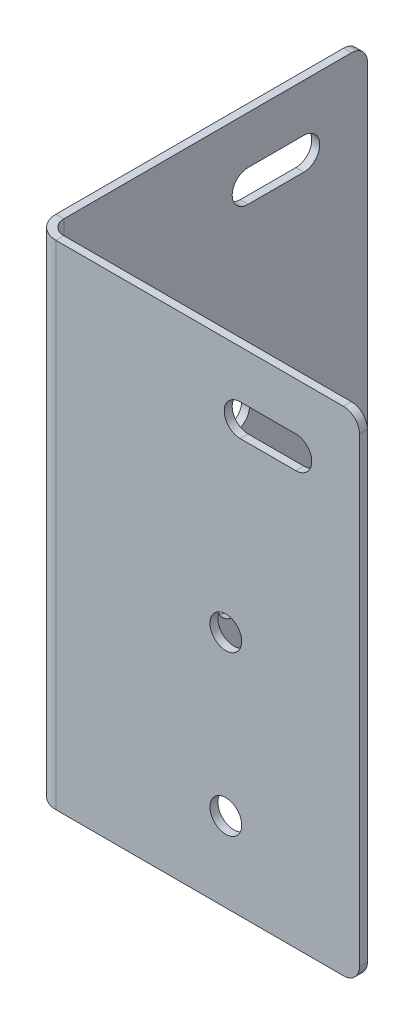
ISO-10303-21;
HEADER;
FILE_DESCRIPTION(('STEP AP214'),'2;1');
FILE_NAME('part.step','',(''),(''),'','','');
FILE_SCHEMA(('AUTOMOTIVE_DESIGN { 1 0 10303 214 1 1 1 1 }'));
ENDSEC;
DATA;
#1=APPLICATION_CONTEXT('core data for automotive mechanical design processes');
#2=APPLICATION_PROTOCOL_DEFINITION('international standard','automotive_design',2000,#1);
#3=PRODUCT_CONTEXT('',#1,'mechanical');
#4=PRODUCT('Part','Part','',(#3));
#5=PRODUCT_RELATED_PRODUCT_CATEGORY('part','',(#4));
#6=PRODUCT_DEFINITION_FORMATION('','',#4);
#7=PRODUCT_DEFINITION_CONTEXT('part definition',#1,'design');
#8=PRODUCT_DEFINITION('design','',#6,#7);
#9=PRODUCT_DEFINITION_SHAPE('','',#8);
#10=(LENGTH_UNIT() NAMED_UNIT(*) SI_UNIT(.MILLI.,.METRE.));
#11=(NAMED_UNIT(*) PLANE_ANGLE_UNIT() SI_UNIT($,.RADIAN.));
#12=(NAMED_UNIT(*) SI_UNIT($,.STERADIAN.) SOLID_ANGLE_UNIT());
#13=UNCERTAINTY_MEASURE_WITH_UNIT(LENGTH_MEASURE(1.E-05),#10,'distance_accuracy_value','');
#14=(GEOMETRIC_REPRESENTATION_CONTEXT(3) GLOBAL_UNCERTAINTY_ASSIGNED_CONTEXT((#13)) GLOBAL_UNIT_ASSIGNED_CONTEXT((#10,
#11,#12)) REPRESENTATION_CONTEXT('',''));
#15=CARTESIAN_POINT('',(0.,0.,0.));
#16=DIRECTION('',(0.,0.,1.));
#17=DIRECTION('',(1.,0.,0.));
#18=AXIS2_PLACEMENT_3D('',#15,#16,#17);
#19=CARTESIAN_POINT('',(1.83,62.,0.));
#20=DIRECTION('',(0.,1.,0.));
#21=DIRECTION('',(0.,0.,1.));
#22=AXIS2_PLACEMENT_3D('',#19,#20,#21);
#23=PLANE('',#22);
#24=DIRECTION('',(0.,0.,1.));
#25=VECTOR('',#24,1.);
#26=CARTESIAN_POINT('',(1.83,62.,0.));
#27=LINE('',#26,#25);
#28=CARTESIAN_POINT('',(1.83,62.,0.));
#29=VERTEX_POINT('',#28);
#30=CARTESIAN_POINT('',(1.83,62.,1.));
#31=VERTEX_POINT('',#30);
#32=EDGE_CURVE('E316',#29,#31,#27,.T.);
#33=ORIENTED_EDGE('',*,*,#32,.F.);
#34=CARTESIAN_POINT('',(1.83,62.,-1.83));
#35=DIRECTION('',(0.,-1.,0.));
#36=DIRECTION('',(0.,0.,-1.));
#37=AXIS2_PLACEMENT_3D('',#34,#35,#36);
#38=CIRCLE('',#37,1.83);
#39=CARTESIAN_POINT('',(0.,62.,-1.83));
#40=VERTEX_POINT('',#39);
#41=EDGE_CURVE('E262',#40,#29,#38,.F.);
#42=ORIENTED_EDGE('',*,*,#41,.F.);
#43=DIRECTION('',(1.,0.,0.));
#44=VECTOR('',#43,1.);
#45=CARTESIAN_POINT('',(-1.,62.,-1.83));
#46=LINE('',#45,#44);
#47=CARTESIAN_POINT('',(-1.,62.,-1.83));
#48=VERTEX_POINT('',#47);
#49=EDGE_CURVE('E313',#48,#40,#46,.T.);
#50=ORIENTED_EDGE('',*,*,#49,.F.);
#51=CARTESIAN_POINT('',(1.83,62.,-1.83));
#52=DIRECTION('',(0.,1.,0.));
#53=DIRECTION('',(1.,0.,0.));
#54=AXIS2_PLACEMENT_3D('',#51,#52,#53);
#55=CIRCLE('',#54,2.83);
#56=EDGE_CURVE('E269',#48,#31,#55,.T.);
#57=ORIENTED_EDGE('',*,*,#56,.T.);
#58=EDGE_LOOP('',(#33,#42,#50,#57));
#59=FACE_BOUND('',#58,.T.);
#60=ADVANCED_FACE('F41',(#59),#23,.T.);
#61=CARTESIAN_POINT('',(-1.,62.,-1.83));
#62=DIRECTION('',(0.,1.,0.));
#63=DIRECTION('',(0.,0.,1.));
#64=AXIS2_PLACEMENT_3D('',#61,#62,#63);
#65=PLANE('',#64);
#66=DIRECTION('',(1.,0.,0.));
#67=VECTOR('',#66,1.);
#68=CARTESIAN_POINT('',(0.,62.,1.));
#69=LINE('',#68,#67);
#70=CARTESIAN_POINT('',(38.,62.,1.));
#71=VERTEX_POINT('',#70);
#72=EDGE_CURVE('E257',#31,#71,#69,.T.);
#73=ORIENTED_EDGE('',*,*,#72,.T.);
#74=DIRECTION('',(0.,0.,1.));
#75=VECTOR('',#74,1.);
#76=CARTESIAN_POINT('',(38.,62.,-1.83));
#77=LINE('',#76,#75);
#78=CARTESIAN_POINT('',(38.,62.,0.));
#79=VERTEX_POINT('',#78);
#80=EDGE_CURVE('E49',#71,#79,#77,.F.);
#81=ORIENTED_EDGE('',*,*,#80,.T.);
#82=DIRECTION('',(1.,0.,0.));
#83=VECTOR('',#82,1.);
#84=CARTESIAN_POINT('',(0.,62.,0.));
#85=LINE('',#84,#83);
#86=EDGE_CURVE('E259',#29,#79,#85,.T.);
#87=ORIENTED_EDGE('',*,*,#86,.F.);
#88=ORIENTED_EDGE('',*,*,#32,.T.);
#89=EDGE_LOOP('',(#73,#81,#87,#88));
#90=FACE_BOUND('',#89,.T.);
#91=ADVANCED_FACE('F392',(#90),#65,.T.);
#92=CARTESIAN_POINT('',(0.,0.,-1.83));
#93=DIRECTION('',(0.,-1.,0.));
#94=DIRECTION('',(0.,0.,-1.));
#95=AXIS2_PLACEMENT_3D('',#92,#93,#94);
#96=PLANE('',#95);
#97=DIRECTION('',(-1.,0.,0.));
#98=VECTOR('',#97,1.);
#99=CARTESIAN_POINT('',(0.,0.,-1.83));
#100=LINE('',#99,#98);
#101=CARTESIAN_POINT('',(0.,0.,-1.83));
#102=VERTEX_POINT('',#101);
#103=CARTESIAN_POINT('',(-1.,0.,-1.83));
#104=VERTEX_POINT('',#103);
#105=EDGE_CURVE('E310',#102,#104,#100,.T.);
#106=ORIENTED_EDGE('',*,*,#105,.F.);
#107=CARTESIAN_POINT('',(1.83,0.,-1.83));
#108=DIRECTION('',(0.,-1.,0.));
#109=DIRECTION('',(0.,0.,-1.));
#110=AXIS2_PLACEMENT_3D('',#107,#108,#109);
#111=CIRCLE('',#110,1.83);
#112=CARTESIAN_POINT('',(1.83,0.,0.));
#113=VERTEX_POINT('',#112);
#114=EDGE_CURVE('E280',#102,#113,#111,.F.);
#115=ORIENTED_EDGE('',*,*,#114,.T.);
#116=DIRECTION('',(0.,0.,-1.));
#117=VECTOR('',#116,1.);
#118=CARTESIAN_POINT('',(1.83,0.,1.));
#119=LINE('',#118,#117);
#120=CARTESIAN_POINT('',(1.83,0.,1.));
#121=VERTEX_POINT('',#120);
#122=EDGE_CURVE('E308',#121,#113,#119,.T.);
#123=ORIENTED_EDGE('',*,*,#122,.F.);
#124=CARTESIAN_POINT('',(1.83,0.,-1.83));
#125=DIRECTION('',(0.,1.,0.));
#126=DIRECTION('',(1.,0.,0.));
#127=AXIS2_PLACEMENT_3D('',#124,#125,#126);
#128=CIRCLE('',#127,2.83);
#129=EDGE_CURVE('E260',#104,#121,#128,.T.);
#130=ORIENTED_EDGE('',*,*,#129,.F.);
#131=EDGE_LOOP('',(#106,#115,#123,#130));
#132=FACE_BOUND('',#131,.T.);
#133=ADVANCED_FACE('F401',(#132),#96,.T.);
#134=CARTESIAN_POINT('',(1.83,0.,1.));
#135=DIRECTION('',(0.,-1.,0.));
#136=DIRECTION('',(0.,0.,-1.));
#137=AXIS2_PLACEMENT_3D('',#134,#135,#136);
#138=PLANE('',#137);
#139=DIRECTION('',(0.,0.,1.));
#140=VECTOR('',#139,1.);
#141=CARTESIAN_POINT('',(-1.,0.,-40.));
#142=LINE('',#141,#140);
#143=CARTESIAN_POINT('',(-1.,0.,-38.));
#144=VERTEX_POINT('',#143);
#145=EDGE_CURVE('E285',#144,#104,#142,.T.);
#146=ORIENTED_EDGE('',*,*,#145,.F.);
#147=DIRECTION('',(1.,0.,0.));
#148=VECTOR('',#147,1.);
#149=CARTESIAN_POINT('',(1.83,0.,-38.));
#150=LINE('',#149,#148);
#151=CARTESIAN_POINT('',(0.,0.,-38.));
#152=VERTEX_POINT('',#151);
#153=EDGE_CURVE('E345',#144,#152,#150,.T.);
#154=ORIENTED_EDGE('',*,*,#153,.T.);
#155=DIRECTION('',(0.,0.,1.));
#156=VECTOR('',#155,1.);
#157=CARTESIAN_POINT('',(0.,0.,-40.));
#158=LINE('',#157,#156);
#159=EDGE_CURVE('E283',#152,#102,#158,.T.);
#160=ORIENTED_EDGE('',*,*,#159,.T.);
#161=ORIENTED_EDGE('',*,*,#105,.T.);
#162=EDGE_LOOP('',(#146,#154,#160,#161));
#163=FACE_BOUND('',#162,.T.);
#164=ADVANCED_FACE('F427',(#163),#138,.T.);
#165=CARTESIAN_POINT('',(0.,62.,1.));
#166=DIRECTION('',(0.,0.,-1.));
#167=DIRECTION('',(-1.,0.,0.));
#168=AXIS2_PLACEMENT_3D('',#165,#166,#167);
#169=PLANE('',#168);
#170=CARTESIAN_POINT('',(23.2,10.,0.999999999999999));
#171=DIRECTION('',(0.,0.,-1.));
#172=DIRECTION('',(-1.,0.,0.));
#173=AXIS2_PLACEMENT_3D('',#170,#171,#172);
#174=CIRCLE('',#173,2.);
#175=CARTESIAN_POINT('',(21.2,10.,0.999999999999999));
#176=VERTEX_POINT('',#175);
#177=EDGE_CURVE('E227',#176,#176,#174,.T.);
#178=ORIENTED_EDGE('',*,*,#177,.T.);
#179=EDGE_LOOP('',(#178));
#180=FACE_BOUND('',#179,.T.);
#181=CARTESIAN_POINT('',(23.2,30.,0.999999999999999));
#182=DIRECTION('',(0.,0.,-1.));
#183=DIRECTION('',(-1.,0.,0.));
#184=AXIS2_PLACEMENT_3D('',#181,#182,#183);
#185=CIRCLE('',#184,2.);
#186=CARTESIAN_POINT('',(21.2,30.,0.999999999999999));
#187=VERTEX_POINT('',#186);
#188=EDGE_CURVE('E224',#187,#187,#185,.T.);
#189=ORIENTED_EDGE('',*,*,#188,.T.);
#190=EDGE_LOOP('',(#189));
#191=FACE_BOUND('',#190,.T.);
#192=DIRECTION('',(1.,0.,0.));
#193=VECTOR('',#192,1.);
#194=CARTESIAN_POINT('',(0.,56.,1.));
#195=LINE('',#194,#193);
#196=CARTESIAN_POINT('',(25.,56.,0.999999999999999));
#197=VERTEX_POINT('',#196);
#198=CARTESIAN_POINT('',(32.,56.,0.999999999999999));
#199=VERTEX_POINT('',#198);
#200=EDGE_CURVE('E218',#197,#199,#195,.T.);
#201=ORIENTED_EDGE('',*,*,#200,.T.);
#202=CARTESIAN_POINT('',(32.,54.,0.999999999999999));
#203=DIRECTION('',(0.,0.,-1.));
#204=DIRECTION('',(-1.,0.,0.));
#205=AXIS2_PLACEMENT_3D('',#202,#203,#204);
#206=CIRCLE('',#205,2.);
#207=CARTESIAN_POINT('',(32.,52.,0.999999999999999));
#208=VERTEX_POINT('',#207);
#209=EDGE_CURVE('E221',#199,#208,#206,.T.);
#210=ORIENTED_EDGE('',*,*,#209,.T.);
#211=DIRECTION('',(-1.,0.,0.));
#212=VECTOR('',#211,1.);
#213=CARTESIAN_POINT('',(0.,52.,1.));
#214=LINE('',#213,#212);
#215=CARTESIAN_POINT('',(25.,52.,1.));
#216=VERTEX_POINT('',#215);
#217=EDGE_CURVE('E214',#208,#216,#214,.T.);
#218=ORIENTED_EDGE('',*,*,#217,.T.);
#219=CARTESIAN_POINT('',(25.,54.,0.999999999999999));
#220=DIRECTION('',(0.,0.,-1.));
#221=DIRECTION('',(-1.,0.,0.));
#222=AXIS2_PLACEMENT_3D('',#219,#220,#221);
#223=CIRCLE('',#222,2.);
#224=EDGE_CURVE('E186',#216,#197,#223,.T.);
#225=ORIENTED_EDGE('',*,*,#224,.T.);
#226=EDGE_LOOP('',(#201,#210,#218,#225));
#227=FACE_BOUND('',#226,.T.);
#228=DIRECTION('',(0.,-1.,0.));
#229=VECTOR('',#228,1.);
#230=CARTESIAN_POINT('',(40.,62.,1.));
#231=LINE('',#230,#229);
#232=CARTESIAN_POINT('',(40.,60.,1.));
#233=VERTEX_POINT('',#232);
#234=CARTESIAN_POINT('',(40.,2.,1.));
#235=VERTEX_POINT('',#234);
#236=EDGE_CURVE('E306',#233,#235,#231,.T.);
#237=ORIENTED_EDGE('',*,*,#236,.F.);
#238=CARTESIAN_POINT('',(38.,60.,1.));
#239=DIRECTION('',(0.,0.,-1.));
#240=DIRECTION('',(-1.,0.,0.));
#241=AXIS2_PLACEMENT_3D('',#238,#239,#240);
#242=CIRCLE('',#241,2.);
#243=EDGE_CURVE('E63',#233,#71,#242,.F.);
#244=ORIENTED_EDGE('',*,*,#243,.T.);
#245=ORIENTED_EDGE('',*,*,#72,.F.);
#246=DIRECTION('',(0.,-1.,0.));
#247=VECTOR('',#246,1.);
#248=CARTESIAN_POINT('',(1.83,62.,1.));
#249=LINE('',#248,#247);
#250=EDGE_CURVE('E272',#31,#121,#249,.T.);
#251=ORIENTED_EDGE('',*,*,#250,.T.);
#252=DIRECTION('',(1.,0.,0.));
#253=VECTOR('',#252,1.);
#254=CARTESIAN_POINT('',(0.,0.,1.));
#255=LINE('',#254,#253);
#256=CARTESIAN_POINT('',(38.,0.,1.));
#257=VERTEX_POINT('',#256);
#258=EDGE_CURVE('E273',#121,#257,#255,.T.);
#259=ORIENTED_EDGE('',*,*,#258,.T.);
#260=CARTESIAN_POINT('',(38.,2.,1.));
#261=DIRECTION('',(0.,0.,-1.));
#262=DIRECTION('',(-1.,0.,0.));
#263=AXIS2_PLACEMENT_3D('',#260,#261,#262);
#264=CIRCLE('',#263,2.);
#265=EDGE_CURVE('E337',#257,#235,#264,.F.);
#266=ORIENTED_EDGE('',*,*,#265,.T.);
#267=EDGE_LOOP('',(#237,#244,#245,#251,#259,#266));
#268=FACE_BOUND('',#267,.T.);
#269=ADVANCED_FACE('F374',(#180,#191,#227,#268),#169,.F.);
#270=CARTESIAN_POINT('',(40.,62.,0.));
#271=DIRECTION('',(1.,0.,0.));
#272=DIRECTION('',(0.,0.,-1.));
#273=AXIS2_PLACEMENT_3D('',#270,#271,#272);
#274=PLANE('',#273);
#275=DIRECTION('',(0.,-1.,0.));
#276=VECTOR('',#275,1.);
#277=CARTESIAN_POINT('',(40.,62.,0.));
#278=LINE('',#277,#276);
#279=CARTESIAN_POINT('',(40.,60.,0.));
#280=VERTEX_POINT('',#279);
#281=CARTESIAN_POINT('',(40.,2.,0.));
#282=VERTEX_POINT('',#281);
#283=EDGE_CURVE('E304',#280,#282,#278,.T.);
#284=ORIENTED_EDGE('',*,*,#283,.F.);
#285=DIRECTION('',(0.,0.,1.));
#286=VECTOR('',#285,1.);
#287=CARTESIAN_POINT('',(40.,60.,0.));
#288=LINE('',#287,#286);
#289=EDGE_CURVE('E365',#280,#233,#288,.T.);
#290=ORIENTED_EDGE('',*,*,#289,.T.);
#291=ORIENTED_EDGE('',*,*,#236,.T.);
#292=DIRECTION('',(0.,0.,1.));
#293=VECTOR('',#292,1.);
#294=CARTESIAN_POINT('',(40.,2.,0.));
#295=LINE('',#294,#293);
#296=EDGE_CURVE('E340',#235,#282,#295,.F.);
#297=ORIENTED_EDGE('',*,*,#296,.T.);
#298=EDGE_LOOP('',(#284,#290,#291,#297));
#299=FACE_BOUND('',#298,.T.);
#300=ADVANCED_FACE('F371',(#299),#274,.T.);
#301=CARTESIAN_POINT('',(0.,62.,0.));
#302=DIRECTION('',(0.,0.,-1.));
#303=DIRECTION('',(-1.,0.,0.));
#304=AXIS2_PLACEMENT_3D('',#301,#302,#303);
#305=PLANE('',#304);
#306=CARTESIAN_POINT('',(23.2,10.,0.));
#307=DIRECTION('',(0.,0.,-1.));
#308=DIRECTION('',(-1.,0.,0.));
#309=AXIS2_PLACEMENT_3D('',#306,#307,#308);
#310=CIRCLE('',#309,2.);
#311=CARTESIAN_POINT('',(21.2,10.,0.));
#312=VERTEX_POINT('',#311);
#313=EDGE_CURVE('E216',#312,#312,#310,.T.);
#314=ORIENTED_EDGE('',*,*,#313,.F.);
#315=EDGE_LOOP('',(#314));
#316=FACE_BOUND('',#315,.T.);
#317=CARTESIAN_POINT('',(23.2,30.,0.));
#318=DIRECTION('',(0.,0.,-1.));
#319=DIRECTION('',(-1.,0.,0.));
#320=AXIS2_PLACEMENT_3D('',#317,#318,#319);
#321=CIRCLE('',#320,2.);
#322=CARTESIAN_POINT('',(21.2,30.,0.));
#323=VERTEX_POINT('',#322);
#324=EDGE_CURVE('E211',#323,#323,#321,.T.);
#325=ORIENTED_EDGE('',*,*,#324,.F.);
#326=EDGE_LOOP('',(#325));
#327=FACE_BOUND('',#326,.T.);
#328=CARTESIAN_POINT('',(32.,54.,0.));
#329=DIRECTION('',(0.,0.,-1.));
#330=DIRECTION('',(-1.,0.,0.));
#331=AXIS2_PLACEMENT_3D('',#328,#329,#330);
#332=CIRCLE('',#331,2.);
#333=CARTESIAN_POINT('',(32.,56.,0.));
#334=VERTEX_POINT('',#333);
#335=CARTESIAN_POINT('',(32.,52.,0.));
#336=VERTEX_POINT('',#335);
#337=EDGE_CURVE('E199',#334,#336,#332,.T.);
#338=ORIENTED_EDGE('',*,*,#337,.F.);
#339=DIRECTION('',(1.,0.,0.));
#340=VECTOR('',#339,1.);
#341=CARTESIAN_POINT('',(32.,56.,0.));
#342=LINE('',#341,#340);
#343=CARTESIAN_POINT('',(25.,56.,0.));
#344=VERTEX_POINT('',#343);
#345=EDGE_CURVE('E204',#344,#334,#342,.T.);
#346=ORIENTED_EDGE('',*,*,#345,.F.);
#347=CARTESIAN_POINT('',(25.,54.,0.));
#348=DIRECTION('',(0.,0.,-1.));
#349=DIRECTION('',(-1.,0.,0.));
#350=AXIS2_PLACEMENT_3D('',#347,#348,#349);
#351=CIRCLE('',#350,2.);
#352=CARTESIAN_POINT('',(25.,52.,0.));
#353=VERTEX_POINT('',#352);
#354=EDGE_CURVE('E183',#353,#344,#351,.T.);
#355=ORIENTED_EDGE('',*,*,#354,.F.);
#356=DIRECTION('',(-1.,0.,0.));
#357=VECTOR('',#356,1.);
#358=CARTESIAN_POINT('',(32.,52.,0.));
#359=LINE('',#358,#357);
#360=EDGE_CURVE('E194',#336,#353,#359,.T.);
#361=ORIENTED_EDGE('',*,*,#360,.F.);
#362=EDGE_LOOP('',(#338,#346,#355,#361));
#363=FACE_BOUND('',#362,.T.);
#364=ORIENTED_EDGE('',*,*,#86,.T.);
#365=CARTESIAN_POINT('',(38.,60.,0.));
#366=DIRECTION('',(0.,0.,-1.));
#367=DIRECTION('',(-1.,0.,0.));
#368=AXIS2_PLACEMENT_3D('',#365,#366,#367);
#369=CIRCLE('',#368,2.);
#370=EDGE_CURVE('E11',#79,#280,#369,.T.);
#371=ORIENTED_EDGE('',*,*,#370,.T.);
#372=ORIENTED_EDGE('',*,*,#283,.T.);
#373=CARTESIAN_POINT('',(38.,2.,0.));
#374=DIRECTION('',(0.,0.,-1.));
#375=DIRECTION('',(-1.,0.,0.));
#376=AXIS2_PLACEMENT_3D('',#373,#374,#375);
#377=CIRCLE('',#376,2.);
#378=CARTESIAN_POINT('',(38.,0.,0.));
#379=VERTEX_POINT('',#378);
#380=EDGE_CURVE('E343',#282,#379,#377,.T.);
#381=ORIENTED_EDGE('',*,*,#380,.T.);
#382=DIRECTION('',(1.,0.,0.));
#383=VECTOR('',#382,1.);
#384=CARTESIAN_POINT('',(0.,0.,0.));
#385=LINE('',#384,#383);
#386=EDGE_CURVE('E276',#113,#379,#385,.T.);
#387=ORIENTED_EDGE('',*,*,#386,.F.);
#388=DIRECTION('',(0.,-1.,0.));
#389=VECTOR('',#388,1.);
#390=CARTESIAN_POINT('',(1.83,62.,0.));
#391=LINE('',#390,#389);
#392=EDGE_CURVE('E301',#29,#113,#391,.T.);
#393=ORIENTED_EDGE('',*,*,#392,.F.);
#394=EDGE_LOOP('',(#364,#371,#372,#381,#387,#393));
#395=FACE_BOUND('',#394,.T.);
#396=ADVANCED_FACE('F201',(#316,#327,#363,#395),#305,.T.);
#397=CARTESIAN_POINT('',(1.83,62.,-1.83));
#398=DIRECTION('',(0.,-1.,0.));
#399=DIRECTION('',(0.,0.,-1.));
#400=AXIS2_PLACEMENT_3D('',#397,#398,#399);
#401=CYLINDRICAL_SURFACE('',#400,1.83);
#402=ORIENTED_EDGE('',*,*,#114,.F.);
#403=DIRECTION('',(0.,-1.,0.));
#404=VECTOR('',#403,1.);
#405=CARTESIAN_POINT('',(0.,62.,-1.83));
#406=LINE('',#405,#404);
#407=EDGE_CURVE('E298',#40,#102,#406,.T.);
#408=ORIENTED_EDGE('',*,*,#407,.F.);
#409=ORIENTED_EDGE('',*,*,#41,.T.);
#410=ORIENTED_EDGE('',*,*,#392,.T.);
#411=EDGE_LOOP('',(#402,#408,#409,#410));
#412=FACE_BOUND('',#411,.T.);
#413=ADVANCED_FACE('F389',(#412),#401,.F.);
#414=CARTESIAN_POINT('',(0.,62.,-40.));
#415=DIRECTION('',(1.,0.,0.));
#416=DIRECTION('',(0.,0.,-1.));
#417=AXIS2_PLACEMENT_3D('',#414,#415,#416);
#418=PLANE('',#417);
#419=CARTESIAN_POINT('',(0.,10.,-23.2));
#420=DIRECTION('',(1.,0.,0.));
#421=DIRECTION('',(0.,0.,-1.));
#422=AXIS2_PLACEMENT_3D('',#419,#420,#421);
#423=CIRCLE('',#422,2.);
#424=CARTESIAN_POINT('',(0.,10.,-25.2));
#425=VERTEX_POINT('',#424);
#426=EDGE_CURVE('E231',#425,#425,#423,.T.);
#427=ORIENTED_EDGE('',*,*,#426,.F.);
#428=EDGE_LOOP('',(#427));
#429=FACE_BOUND('',#428,.T.);
#430=CARTESIAN_POINT('',(0.,30.,-23.2));
#431=DIRECTION('',(1.,0.,0.));
#432=DIRECTION('',(0.,0.,-1.));
#433=AXIS2_PLACEMENT_3D('',#430,#431,#432);
#434=CIRCLE('',#433,2.);
#435=CARTESIAN_POINT('',(0.,30.,-25.2));
#436=VERTEX_POINT('',#435);
#437=EDGE_CURVE('E235',#436,#436,#434,.T.);
#438=ORIENTED_EDGE('',*,*,#437,.F.);
#439=EDGE_LOOP('',(#438));
#440=FACE_BOUND('',#439,.T.);
#441=CARTESIAN_POINT('',(0.,54.,-25.));
#442=DIRECTION('',(1.,0.,0.));
#443=DIRECTION('',(0.,0.,-1.));
#444=AXIS2_PLACEMENT_3D('',#441,#442,#443);
#445=CIRCLE('',#444,2.);
#446=CARTESIAN_POINT('',(0.,56.,-25.));
#447=VERTEX_POINT('',#446);
#448=CARTESIAN_POINT('',(0.,52.,-25.));
#449=VERTEX_POINT('',#448);
#450=EDGE_CURVE('E230',#447,#449,#445,.T.);
#451=ORIENTED_EDGE('',*,*,#450,.F.);
#452=DIRECTION('',(0.,0.,1.));
#453=VECTOR('',#452,1.);
#454=CARTESIAN_POINT('',(0.,56.,-25.));
#455=LINE('',#454,#453);
#456=CARTESIAN_POINT('',(0.,56.,-32.));
#457=VERTEX_POINT('',#456);
#458=EDGE_CURVE('E246',#457,#447,#455,.T.);
#459=ORIENTED_EDGE('',*,*,#458,.F.);
#460=CARTESIAN_POINT('',(0.,54.,-32.));
#461=DIRECTION('',(1.,0.,0.));
#462=DIRECTION('',(0.,0.,-1.));
#463=AXIS2_PLACEMENT_3D('',#460,#461,#462);
#464=CIRCLE('',#463,2.);
#465=CARTESIAN_POINT('',(0.,52.,-32.));
#466=VERTEX_POINT('',#465);
#467=EDGE_CURVE('E243',#466,#457,#464,.T.);
#468=ORIENTED_EDGE('',*,*,#467,.F.);
#469=DIRECTION('',(0.,0.,-1.));
#470=VECTOR('',#469,1.);
#471=CARTESIAN_POINT('',(0.,52.,-25.));
#472=LINE('',#471,#470);
#473=EDGE_CURVE('E240',#449,#466,#472,.T.);
#474=ORIENTED_EDGE('',*,*,#473,.F.);
#475=EDGE_LOOP('',(#451,#459,#468,#474));
#476=FACE_BOUND('',#475,.T.);
#477=DIRECTION('',(0.,-1.,0.));
#478=VECTOR('',#477,1.);
#479=CARTESIAN_POINT('',(0.,62.,-40.));
#480=LINE('',#479,#478);
#481=CARTESIAN_POINT('',(0.,60.,-40.));
#482=VERTEX_POINT('',#481);
#483=CARTESIAN_POINT('',(0.,2.,-40.));
#484=VERTEX_POINT('',#483);
#485=EDGE_CURVE('E296',#482,#484,#480,.T.);
#486=ORIENTED_EDGE('',*,*,#485,.F.);
#487=CARTESIAN_POINT('',(0.,60.,-38.));
#488=DIRECTION('',(1.,0.,0.));
#489=DIRECTION('',(0.,0.,-1.));
#490=AXIS2_PLACEMENT_3D('',#487,#488,#489);
#491=CIRCLE('',#490,2.);
#492=CARTESIAN_POINT('',(0.,62.,-38.));
#493=VERTEX_POINT('',#492);
#494=EDGE_CURVE('E359',#482,#493,#491,.T.);
#495=ORIENTED_EDGE('',*,*,#494,.T.);
#496=DIRECTION('',(0.,0.,1.));
#497=VECTOR('',#496,1.);
#498=CARTESIAN_POINT('',(0.,62.,-40.));
#499=LINE('',#498,#497);
#500=EDGE_CURVE('E265',#493,#40,#499,.T.);
#501=ORIENTED_EDGE('',*,*,#500,.T.);
#502=ORIENTED_EDGE('',*,*,#407,.T.);
#503=ORIENTED_EDGE('',*,*,#159,.F.);
#504=CARTESIAN_POINT('',(0.,2.,-38.));
#505=DIRECTION('',(1.,0.,0.));
#506=DIRECTION('',(0.,0.,-1.));
#507=AXIS2_PLACEMENT_3D('',#504,#505,#506);
#508=CIRCLE('',#507,2.);
#509=EDGE_CURVE('E348',#152,#484,#508,.T.);
#510=ORIENTED_EDGE('',*,*,#509,.T.);
#511=EDGE_LOOP('',(#486,#495,#501,#502,#503,#510));
#512=FACE_BOUND('',#511,.T.);
#513=ADVANCED_FACE('F407',(#429,#440,#476,#512),#418,.T.);
#514=CARTESIAN_POINT('',(-1.,62.,-40.));
#515=DIRECTION('',(0.,0.,-1.));
#516=DIRECTION('',(-1.,0.,0.));
#517=AXIS2_PLACEMENT_3D('',#514,#515,#516);
#518=PLANE('',#517);
#519=DIRECTION('',(0.,-1.,0.));
#520=VECTOR('',#519,1.);
#521=CARTESIAN_POINT('',(-1.,62.,-40.));
#522=LINE('',#521,#520);
#523=CARTESIAN_POINT('',(-1.,60.,-40.));
#524=VERTEX_POINT('',#523);
#525=CARTESIAN_POINT('',(-1.,2.,-40.));
#526=VERTEX_POINT('',#525);
#527=EDGE_CURVE('E294',#524,#526,#522,.T.);
#528=ORIENTED_EDGE('',*,*,#527,.F.);
#529=DIRECTION('',(1.,0.,0.));
#530=VECTOR('',#529,1.);
#531=CARTESIAN_POINT('',(0.,60.,-40.));
#532=LINE('',#531,#530);
#533=EDGE_CURVE('E356',#524,#482,#532,.T.);
#534=ORIENTED_EDGE('',*,*,#533,.T.);
#535=ORIENTED_EDGE('',*,*,#485,.T.);
#536=DIRECTION('',(1.,0.,0.));
#537=VECTOR('',#536,1.);
#538=CARTESIAN_POINT('',(-1.,2.,-40.));
#539=LINE('',#538,#537);
#540=EDGE_CURVE('E351',#484,#526,#539,.F.);
#541=ORIENTED_EDGE('',*,*,#540,.T.);
#542=EDGE_LOOP('',(#528,#534,#535,#541));
#543=FACE_BOUND('',#542,.T.);
#544=ADVANCED_FACE('F421',(#543),#518,.T.);
#545=CARTESIAN_POINT('',(-1.,62.,-40.));
#546=DIRECTION('',(1.,0.,0.));
#547=DIRECTION('',(0.,0.,-1.));
#548=AXIS2_PLACEMENT_3D('',#545,#546,#547);
#549=PLANE('',#548);
#550=CARTESIAN_POINT('',(-1.,10.,-23.2));
#551=DIRECTION('',(1.,0.,0.));
#552=DIRECTION('',(0.,0.,-1.));
#553=AXIS2_PLACEMENT_3D('',#550,#551,#552);
#554=CIRCLE('',#553,2.);
#555=CARTESIAN_POINT('',(-1.,10.,-25.2));
#556=VERTEX_POINT('',#555);
#557=EDGE_CURVE('E277',#556,#556,#554,.T.);
#558=ORIENTED_EDGE('',*,*,#557,.T.);
#559=EDGE_LOOP('',(#558));
#560=FACE_BOUND('',#559,.T.);
#561=CARTESIAN_POINT('',(-1.,30.,-23.2));
#562=DIRECTION('',(1.,0.,0.));
#563=DIRECTION('',(0.,0.,-1.));
#564=AXIS2_PLACEMENT_3D('',#561,#562,#563);
#565=CIRCLE('',#564,2.);
#566=CARTESIAN_POINT('',(-1.,30.,-25.2));
#567=VERTEX_POINT('',#566);
#568=EDGE_CURVE('E234',#567,#567,#565,.T.);
#569=ORIENTED_EDGE('',*,*,#568,.T.);
#570=EDGE_LOOP('',(#569));
#571=FACE_BOUND('',#570,.T.);
#572=DIRECTION('',(0.,0.,1.));
#573=VECTOR('',#572,1.);
#574=CARTESIAN_POINT('',(-1.,56.,-40.));
#575=LINE('',#574,#573);
#576=CARTESIAN_POINT('',(-1.,56.,-32.));
#577=VERTEX_POINT('',#576);
#578=CARTESIAN_POINT('',(-1.,56.,-25.));
#579=VERTEX_POINT('',#578);
#580=EDGE_CURVE('E324',#577,#579,#575,.T.);
#581=ORIENTED_EDGE('',*,*,#580,.T.);
#582=CARTESIAN_POINT('',(-1.,54.,-25.));
#583=DIRECTION('',(1.,0.,0.));
#584=DIRECTION('',(0.,0.,-1.));
#585=AXIS2_PLACEMENT_3D('',#582,#583,#584);
#586=CIRCLE('',#585,2.);
#587=CARTESIAN_POINT('',(-1.,52.,-25.));
#588=VERTEX_POINT('',#587);
#589=EDGE_CURVE('E327',#579,#588,#586,.T.);
#590=ORIENTED_EDGE('',*,*,#589,.T.);
#591=DIRECTION('',(0.,0.,-1.));
#592=VECTOR('',#591,1.);
#593=CARTESIAN_POINT('',(-1.,52.,-40.));
#594=LINE('',#593,#592);
#595=CARTESIAN_POINT('',(-1.,52.,-32.));
#596=VERTEX_POINT('',#595);
#597=EDGE_CURVE('E318',#588,#596,#594,.T.);
#598=ORIENTED_EDGE('',*,*,#597,.T.);
#599=CARTESIAN_POINT('',(-1.,54.,-32.));
#600=DIRECTION('',(1.,0.,0.));
#601=DIRECTION('',(0.,0.,-1.));
#602=AXIS2_PLACEMENT_3D('',#599,#600,#601);
#603=CIRCLE('',#602,2.);
#604=EDGE_CURVE('E321',#596,#577,#603,.T.);
#605=ORIENTED_EDGE('',*,*,#604,.T.);
#606=EDGE_LOOP('',(#581,#590,#598,#605));
#607=FACE_BOUND('',#606,.T.);
#608=DIRECTION('',(0.,0.,1.));
#609=VECTOR('',#608,1.);
#610=CARTESIAN_POINT('',(-1.,62.,-40.));
#611=LINE('',#610,#609);
#612=CARTESIAN_POINT('',(-1.,62.,-38.));
#613=VERTEX_POINT('',#612);
#614=EDGE_CURVE('E267',#613,#48,#611,.T.);
#615=ORIENTED_EDGE('',*,*,#614,.F.);
#616=CARTESIAN_POINT('',(-1.,60.,-38.));
#617=DIRECTION('',(1.,0.,0.));
#618=DIRECTION('',(0.,0.,-1.));
#619=AXIS2_PLACEMENT_3D('',#616,#617,#618);
#620=CIRCLE('',#619,2.);
#621=EDGE_CURVE('E363',#613,#524,#620,.F.);
#622=ORIENTED_EDGE('',*,*,#621,.T.);
#623=ORIENTED_EDGE('',*,*,#527,.T.);
#624=CARTESIAN_POINT('',(-1.,2.,-38.));
#625=DIRECTION('',(1.,0.,0.));
#626=DIRECTION('',(0.,0.,-1.));
#627=AXIS2_PLACEMENT_3D('',#624,#625,#626);
#628=CIRCLE('',#627,2.);
#629=EDGE_CURVE('E354',#526,#144,#628,.F.);
#630=ORIENTED_EDGE('',*,*,#629,.T.);
#631=ORIENTED_EDGE('',*,*,#145,.T.);
#632=DIRECTION('',(0.,-1.,0.));
#633=VECTOR('',#632,1.);
#634=CARTESIAN_POINT('',(-1.,62.,-1.83));
#635=LINE('',#634,#633);
#636=EDGE_CURVE('E291',#48,#104,#635,.T.);
#637=ORIENTED_EDGE('',*,*,#636,.F.);
#638=EDGE_LOOP('',(#615,#622,#623,#630,#631,#637));
#639=FACE_BOUND('',#638,.T.);
#640=ADVANCED_FACE('F415',(#560,#571,#607,#639),#549,.F.);
#641=CARTESIAN_POINT('',(1.83,62.,-1.83));
#642=DIRECTION('',(0.,-1.,0.));
#643=DIRECTION('',(0.,0.,-1.));
#644=AXIS2_PLACEMENT_3D('',#641,#642,#643);
#645=CYLINDRICAL_SURFACE('',#644,2.83);
#646=ORIENTED_EDGE('',*,*,#129,.T.);
#647=ORIENTED_EDGE('',*,*,#250,.F.);
#648=ORIENTED_EDGE('',*,*,#56,.F.);
#649=ORIENTED_EDGE('',*,*,#636,.T.);
#650=EDGE_LOOP('',(#646,#647,#648,#649));
#651=FACE_BOUND('',#650,.T.);
#652=ADVANCED_FACE('F399',(#651),#645,.T.);
#653=CARTESIAN_POINT('',(1.83,62.,-1.83));
#654=DIRECTION('',(0.,-1.,0.));
#655=DIRECTION('',(-1.,0.,0.));
#656=AXIS2_PLACEMENT_3D('',#653,#654,#655);
#657=PLANE('',#656);
#658=ORIENTED_EDGE('',*,*,#500,.F.);
#659=DIRECTION('',(1.,0.,0.));
#660=VECTOR('',#659,1.);
#661=CARTESIAN_POINT('',(-1.,62.,-38.));
#662=LINE('',#661,#660);
#663=EDGE_CURVE('E361',#493,#613,#662,.F.);
#664=ORIENTED_EDGE('',*,*,#663,.T.);
#665=ORIENTED_EDGE('',*,*,#614,.T.);
#666=ORIENTED_EDGE('',*,*,#49,.T.);
#667=EDGE_LOOP('',(#658,#664,#665,#666));
#668=FACE_BOUND('',#667,.T.);
#669=ADVANCED_FACE('F411',(#668),#657,.F.);
#670=CARTESIAN_POINT('',(1.83,0.,-1.83));
#671=DIRECTION('',(0.,-1.,0.));
#672=DIRECTION('',(-1.,0.,0.));
#673=AXIS2_PLACEMENT_3D('',#670,#671,#672);
#674=PLANE('',#673);
#675=ORIENTED_EDGE('',*,*,#386,.T.);
#676=DIRECTION('',(0.,0.,1.));
#677=VECTOR('',#676,1.);
#678=CARTESIAN_POINT('',(38.,0.,-1.83));
#679=LINE('',#678,#677);
#680=EDGE_CURVE('E330',#379,#257,#679,.T.);
#681=ORIENTED_EDGE('',*,*,#680,.T.);
#682=ORIENTED_EDGE('',*,*,#258,.F.);
#683=ORIENTED_EDGE('',*,*,#122,.T.);
#684=EDGE_LOOP('',(#675,#681,#682,#683));
#685=FACE_BOUND('',#684,.T.);
#686=ADVANCED_FACE('F384',(#685),#674,.T.);
#687=CARTESIAN_POINT('',(-10.,54.,-25.));
#688=DIRECTION('',(1.,0.,0.));
#689=DIRECTION('',(0.,0.,-1.));
#690=AXIS2_PLACEMENT_3D('',#687,#688,#689);
#691=CYLINDRICAL_SURFACE('',#690,2.);
#692=DIRECTION('',(1.,0.,0.));
#693=VECTOR('',#692,1.);
#694=CARTESIAN_POINT('',(-10.,56.,-25.));
#695=LINE('',#694,#693);
#696=EDGE_CURVE('E238',#579,#447,#695,.T.);
#697=ORIENTED_EDGE('',*,*,#696,.T.);
#698=ORIENTED_EDGE('',*,*,#450,.T.);
#699=DIRECTION('',(1.,0.,0.));
#700=VECTOR('',#699,1.);
#701=CARTESIAN_POINT('',(-10.,52.,-25.));
#702=LINE('',#701,#700);
#703=EDGE_CURVE('E249',#588,#449,#702,.T.);
#704=ORIENTED_EDGE('',*,*,#703,.F.);
#705=ORIENTED_EDGE('',*,*,#589,.F.);
#706=EDGE_LOOP('',(#697,#698,#704,#705));
#707=FACE_BOUND('',#706,.T.);
#708=ADVANCED_FACE('F558',(#707),#691,.F.);
#709=CARTESIAN_POINT('',(-10.,56.,-25.));
#710=DIRECTION('',(0.,1.,0.));
#711=DIRECTION('',(0.,0.,1.));
#712=AXIS2_PLACEMENT_3D('',#709,#710,#711);
#713=PLANE('',#712);
#714=DIRECTION('',(1.,0.,0.));
#715=VECTOR('',#714,1.);
#716=CARTESIAN_POINT('',(-10.,56.,-32.));
#717=LINE('',#716,#715);
#718=EDGE_CURVE('E251',#577,#457,#717,.T.);
#719=ORIENTED_EDGE('',*,*,#718,.T.);
#720=ORIENTED_EDGE('',*,*,#458,.T.);
#721=ORIENTED_EDGE('',*,*,#696,.F.);
#722=ORIENTED_EDGE('',*,*,#580,.F.);
#723=EDGE_LOOP('',(#719,#720,#721,#722));
#724=FACE_BOUND('',#723,.T.);
#725=ADVANCED_FACE('F668',(#724),#713,.F.);
#726=CARTESIAN_POINT('',(-10.,54.,-32.));
#727=DIRECTION('',(1.,0.,0.));
#728=DIRECTION('',(0.,0.,-1.));
#729=AXIS2_PLACEMENT_3D('',#726,#727,#728);
#730=CYLINDRICAL_SURFACE('',#729,2.);
#731=DIRECTION('',(1.,0.,0.));
#732=VECTOR('',#731,1.);
#733=CARTESIAN_POINT('',(-10.,52.,-32.));
#734=LINE('',#733,#732);
#735=EDGE_CURVE('E253',#596,#466,#734,.T.);
#736=ORIENTED_EDGE('',*,*,#735,.T.);
#737=ORIENTED_EDGE('',*,*,#467,.T.);
#738=ORIENTED_EDGE('',*,*,#718,.F.);
#739=ORIENTED_EDGE('',*,*,#604,.F.);
#740=EDGE_LOOP('',(#736,#737,#738,#739));
#741=FACE_BOUND('',#740,.T.);
#742=ADVANCED_FACE('F657',(#741),#730,.F.);
#743=CARTESIAN_POINT('',(-10.,52.,-25.));
#744=DIRECTION('',(0.,-1.,0.));
#745=DIRECTION('',(0.,0.,-1.));
#746=AXIS2_PLACEMENT_3D('',#743,#744,#745);
#747=PLANE('',#746);
#748=ORIENTED_EDGE('',*,*,#703,.T.);
#749=ORIENTED_EDGE('',*,*,#473,.T.);
#750=ORIENTED_EDGE('',*,*,#735,.F.);
#751=ORIENTED_EDGE('',*,*,#597,.F.);
#752=EDGE_LOOP('',(#748,#749,#750,#751));
#753=FACE_BOUND('',#752,.T.);
#754=ADVANCED_FACE('F646',(#753),#747,.F.);
#755=CARTESIAN_POINT('',(-10.,30.,-23.2));
#756=DIRECTION('',(1.,0.,0.));
#757=DIRECTION('',(0.,0.,-1.));
#758=AXIS2_PLACEMENT_3D('',#755,#756,#757);
#759=CYLINDRICAL_SURFACE('',#758,2.);
#760=ORIENTED_EDGE('',*,*,#437,.T.);
#761=EDGE_LOOP('',(#760));
#762=FACE_BOUND('',#761,.T.);
#763=ORIENTED_EDGE('',*,*,#568,.F.);
#764=EDGE_LOOP('',(#763));
#765=FACE_BOUND('',#764,.T.);
#766=ADVANCED_FACE('F635',(#762,#765),#759,.F.);
#767=CARTESIAN_POINT('',(-10.,10.,-23.2));
#768=DIRECTION('',(1.,0.,0.));
#769=DIRECTION('',(0.,0.,-1.));
#770=AXIS2_PLACEMENT_3D('',#767,#768,#769);
#771=CYLINDRICAL_SURFACE('',#770,2.);
#772=ORIENTED_EDGE('',*,*,#426,.T.);
#773=EDGE_LOOP('',(#772));
#774=FACE_BOUND('',#773,.T.);
#775=ORIENTED_EDGE('',*,*,#557,.F.);
#776=EDGE_LOOP('',(#775));
#777=FACE_BOUND('',#776,.T.);
#778=ADVANCED_FACE('F624',(#774,#777),#771,.F.);
#779=CARTESIAN_POINT('',(32.,54.,10.));
#780=DIRECTION('',(0.,0.,-1.));
#781=DIRECTION('',(-1.,0.,0.));
#782=AXIS2_PLACEMENT_3D('',#779,#780,#781);
#783=CYLINDRICAL_SURFACE('',#782,2.);
#784=DIRECTION('',(0.,0.,-1.));
#785=VECTOR('',#784,1.);
#786=CARTESIAN_POINT('',(32.,56.,10.));
#787=LINE('',#786,#785);
#788=EDGE_CURVE('E209',#199,#334,#787,.T.);
#789=ORIENTED_EDGE('',*,*,#788,.T.);
#790=ORIENTED_EDGE('',*,*,#337,.T.);
#791=DIRECTION('',(0.,0.,-1.));
#792=VECTOR('',#791,1.);
#793=CARTESIAN_POINT('',(32.,52.,10.));
#794=LINE('',#793,#792);
#795=EDGE_CURVE('E190',#208,#336,#794,.T.);
#796=ORIENTED_EDGE('',*,*,#795,.F.);
#797=ORIENTED_EDGE('',*,*,#209,.F.);
#798=EDGE_LOOP('',(#789,#790,#796,#797));
#799=FACE_BOUND('',#798,.T.);
#800=ADVANCED_FACE('F613',(#799),#783,.F.);
#801=CARTESIAN_POINT('',(32.,56.,10.));
#802=DIRECTION('',(0.,1.,0.));
#803=DIRECTION('',(0.,0.,1.));
#804=AXIS2_PLACEMENT_3D('',#801,#802,#803);
#805=PLANE('',#804);
#806=DIRECTION('',(0.,0.,-1.));
#807=VECTOR('',#806,1.);
#808=CARTESIAN_POINT('',(25.,56.,10.));
#809=LINE('',#808,#807);
#810=EDGE_CURVE('E189',#197,#344,#809,.T.);
#811=ORIENTED_EDGE('',*,*,#810,.T.);
#812=ORIENTED_EDGE('',*,*,#345,.T.);
#813=ORIENTED_EDGE('',*,*,#788,.F.);
#814=ORIENTED_EDGE('',*,*,#200,.F.);
#815=EDGE_LOOP('',(#811,#812,#813,#814));
#816=FACE_BOUND('',#815,.T.);
#817=ADVANCED_FACE('F603',(#816),#805,.F.);
#818=CARTESIAN_POINT('',(25.,54.,10.));
#819=DIRECTION('',(0.,0.,-1.));
#820=DIRECTION('',(-1.,0.,0.));
#821=AXIS2_PLACEMENT_3D('',#818,#819,#820);
#822=CYLINDRICAL_SURFACE('',#821,2.);
#823=DIRECTION('',(0.,0.,-1.));
#824=VECTOR('',#823,1.);
#825=CARTESIAN_POINT('',(25.,52.,10.));
#826=LINE('',#825,#824);
#827=EDGE_CURVE('E178',#216,#353,#826,.T.);
#828=ORIENTED_EDGE('',*,*,#827,.T.);
#829=ORIENTED_EDGE('',*,*,#354,.T.);
#830=ORIENTED_EDGE('',*,*,#810,.F.);
#831=ORIENTED_EDGE('',*,*,#224,.F.);
#832=EDGE_LOOP('',(#828,#829,#830,#831));
#833=FACE_BOUND('',#832,.T.);
#834=ADVANCED_FACE('F180',(#833),#822,.F.);
#835=CARTESIAN_POINT('',(32.,52.,10.));
#836=DIRECTION('',(0.,-1.,0.));
#837=DIRECTION('',(0.,0.,-1.));
#838=AXIS2_PLACEMENT_3D('',#835,#836,#837);
#839=PLANE('',#838);
#840=ORIENTED_EDGE('',*,*,#795,.T.);
#841=ORIENTED_EDGE('',*,*,#360,.T.);
#842=ORIENTED_EDGE('',*,*,#827,.F.);
#843=ORIENTED_EDGE('',*,*,#217,.F.);
#844=EDGE_LOOP('',(#840,#841,#842,#843));
#845=FACE_BOUND('',#844,.T.);
#846=ADVANCED_FACE('F195',(#845),#839,.F.);
#847=CARTESIAN_POINT('',(23.2,30.,10.));
#848=DIRECTION('',(0.,0.,-1.));
#849=DIRECTION('',(-1.,0.,0.));
#850=AXIS2_PLACEMENT_3D('',#847,#848,#849);
#851=CYLINDRICAL_SURFACE('',#850,2.);
#852=ORIENTED_EDGE('',*,*,#324,.T.);
#853=EDGE_LOOP('',(#852));
#854=FACE_BOUND('',#853,.T.);
#855=ORIENTED_EDGE('',*,*,#188,.F.);
#856=EDGE_LOOP('',(#855));
#857=FACE_BOUND('',#856,.T.);
#858=ADVANCED_FACE('F573',(#854,#857),#851,.F.);
#859=CARTESIAN_POINT('',(23.2,10.,10.));
#860=DIRECTION('',(0.,0.,-1.));
#861=DIRECTION('',(-1.,0.,0.));
#862=AXIS2_PLACEMENT_3D('',#859,#860,#861);
#863=CYLINDRICAL_SURFACE('',#862,2.);
#864=ORIENTED_EDGE('',*,*,#313,.T.);
#865=EDGE_LOOP('',(#864));
#866=FACE_BOUND('',#865,.T.);
#867=ORIENTED_EDGE('',*,*,#177,.F.);
#868=EDGE_LOOP('',(#867));
#869=FACE_BOUND('',#868,.T.);
#870=ADVANCED_FACE('F446',(#866,#869),#863,.F.);
#871=CARTESIAN_POINT('',(38.,2.,-1.83));
#872=DIRECTION('',(0.,0.,1.));
#873=DIRECTION('',(1.,0.,0.));
#874=AXIS2_PLACEMENT_3D('',#871,#872,#873);
#875=CYLINDRICAL_SURFACE('',#874,2.);
#876=ORIENTED_EDGE('',*,*,#380,.F.);
#877=ORIENTED_EDGE('',*,*,#296,.F.);
#878=ORIENTED_EDGE('',*,*,#265,.F.);
#879=ORIENTED_EDGE('',*,*,#680,.F.);
#880=EDGE_LOOP('',(#876,#877,#878,#879));
#881=FACE_BOUND('',#880,.T.);
#882=ADVANCED_FACE('F380',(#881),#875,.T.);
#883=CARTESIAN_POINT('',(1.83,2.,-38.));
#884=DIRECTION('',(1.,0.,0.));
#885=DIRECTION('',(0.,0.,-1.));
#886=AXIS2_PLACEMENT_3D('',#883,#884,#885);
#887=CYLINDRICAL_SURFACE('',#886,2.);
#888=ORIENTED_EDGE('',*,*,#629,.F.);
#889=ORIENTED_EDGE('',*,*,#540,.F.);
#890=ORIENTED_EDGE('',*,*,#509,.F.);
#891=ORIENTED_EDGE('',*,*,#153,.F.);
#892=EDGE_LOOP('',(#888,#889,#890,#891));
#893=FACE_BOUND('',#892,.T.);
#894=ADVANCED_FACE('F426',(#893),#887,.T.);
#895=CARTESIAN_POINT('',(-1.,60.,-38.));
#896=DIRECTION('',(-1.,0.,0.));
#897=DIRECTION('',(0.,0.,1.));
#898=AXIS2_PLACEMENT_3D('',#895,#896,#897);
#899=CYLINDRICAL_SURFACE('',#898,2.);
#900=ORIENTED_EDGE('',*,*,#621,.F.);
#901=ORIENTED_EDGE('',*,*,#663,.F.);
#902=ORIENTED_EDGE('',*,*,#494,.F.);
#903=ORIENTED_EDGE('',*,*,#533,.F.);
#904=EDGE_LOOP('',(#900,#901,#902,#903));
#905=FACE_BOUND('',#904,.T.);
#906=ADVANCED_FACE('F419',(#905),#899,.T.);
#907=CARTESIAN_POINT('',(38.,60.,0.));
#908=DIRECTION('',(0.,0.,1.));
#909=DIRECTION('',(1.,0.,0.));
#910=AXIS2_PLACEMENT_3D('',#907,#908,#909);
#911=CYLINDRICAL_SURFACE('',#910,2.);
#912=ORIENTED_EDGE('',*,*,#370,.F.);
#913=ORIENTED_EDGE('',*,*,#80,.F.);
#914=ORIENTED_EDGE('',*,*,#243,.F.);
#915=ORIENTED_EDGE('',*,*,#289,.F.);
#916=EDGE_LOOP('',(#912,#913,#914,#915));
#917=FACE_BOUND('',#916,.T.);
#918=ADVANCED_FACE('F43',(#917),#911,.T.);
#919=CLOSED_SHELL('',(#60,#91,#133,#164,#269,#300,#396,#413,#513,#544,#640,#652,#669,#686,#708,
#725,#742,#754,#766,#778,#800,#817,#834,#846,#858,#870,#882,#894,#906,#918));
#920=MANIFOLD_SOLID_BREP('B2',#919);
#921=ADVANCED_BREP_SHAPE_REPRESENTATION('',(#18,#920),#14);
#922=SHAPE_DEFINITION_REPRESENTATION(#9,#921);
ENDSEC;
END-ISO-10303-21;
